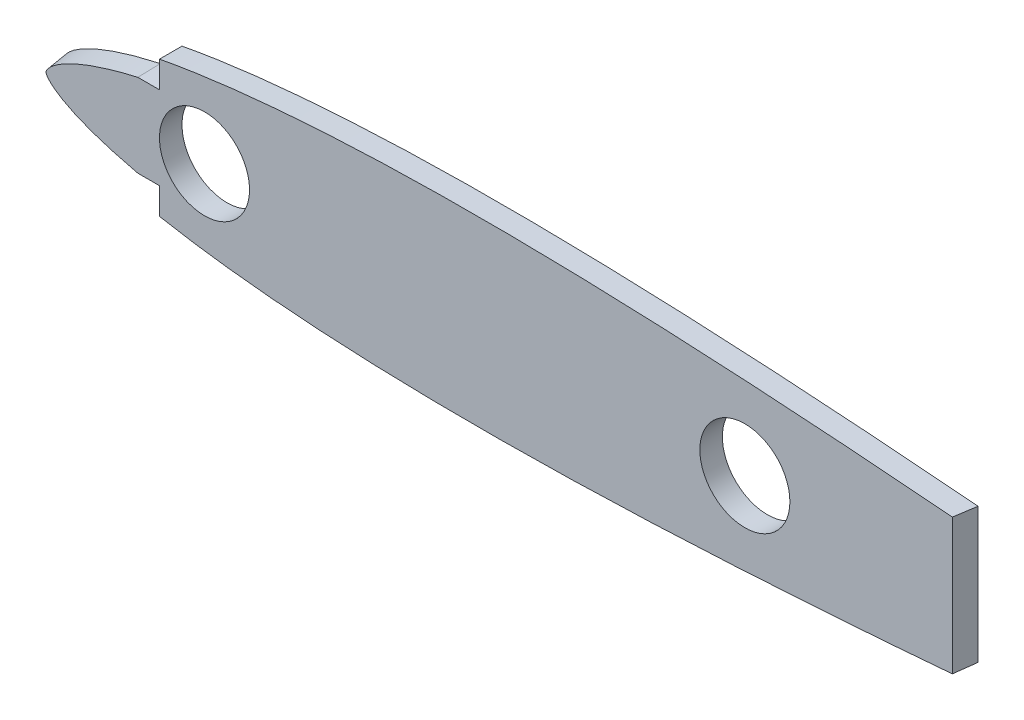
ISO-10303-21;
HEADER;
FILE_DESCRIPTION(('STEP AP214'),'2;1');
FILE_NAME('part.step','',(''),(''),'','','');
FILE_SCHEMA(('AUTOMOTIVE_DESIGN { 1 0 10303 214 1 1 1 1 }'));
ENDSEC;
DATA;
#1=APPLICATION_CONTEXT('core data for automotive mechanical design processes');
#2=APPLICATION_PROTOCOL_DEFINITION('international standard','automotive_design',2000,#1);
#3=PRODUCT_CONTEXT('',#1,'mechanical');
#4=PRODUCT('Part','Part','',(#3));
#5=PRODUCT_RELATED_PRODUCT_CATEGORY('part','',(#4));
#6=PRODUCT_DEFINITION_FORMATION('','',#4);
#7=PRODUCT_DEFINITION_CONTEXT('part definition',#1,'design');
#8=PRODUCT_DEFINITION('design','',#6,#7);
#9=PRODUCT_DEFINITION_SHAPE('','',#8);
#10=(LENGTH_UNIT() NAMED_UNIT(*) SI_UNIT(.MILLI.,.METRE.));
#11=(NAMED_UNIT(*) PLANE_ANGLE_UNIT() SI_UNIT($,.RADIAN.));
#12=(NAMED_UNIT(*) SI_UNIT($,.STERADIAN.) SOLID_ANGLE_UNIT());
#13=UNCERTAINTY_MEASURE_WITH_UNIT(LENGTH_MEASURE(1.E-05),#10,'distance_accuracy_value','');
#14=(GEOMETRIC_REPRESENTATION_CONTEXT(3) GLOBAL_UNCERTAINTY_ASSIGNED_CONTEXT((#13)) GLOBAL_UNIT_ASSIGNED_CONTEXT((#10,
#11,#12)) REPRESENTATION_CONTEXT('',''));
#15=CARTESIAN_POINT('',(0.,0.,0.));
#16=DIRECTION('',(0.,0.,1.));
#17=DIRECTION('',(1.,0.,0.));
#18=AXIS2_PLACEMENT_3D('',#15,#16,#17);
#19=CARTESIAN_POINT('',(214.122,0.26979372,3.175));
#20=CARTESIAN_POINT('',(214.042517560815,0.336401081243854,3.175));
#21=CARTESIAN_POINT('',(213.528971008812,0.273510813659236,3.175));
#22=CARTESIAN_POINT('',(212.614475706084,0.530942112134174,3.175));
#23=CARTESIAN_POINT('',(210.93741297643,0.69005818023402,3.175));
#24=CARTESIAN_POINT('',(208.678154780773,1.03154078288429,3.175));
#25=CARTESIAN_POINT('',(205.767891793944,1.41261255706814,3.175));
#26=CARTESIAN_POINT('',(202.258298365244,1.8822660000615,3.175));
#27=CARTESIAN_POINT('',(198.15850540465,2.41316460028215,3.175));
#28=CARTESIAN_POINT('',(193.498201345533,3.00425135927741,3.175));
#29=CARTESIAN_POINT('',(188.304622899694,3.64517141354976,3.175));
#30=CARTESIAN_POINT('',(182.610259265293,4.32725083103619,3.175));
#31=CARTESIAN_POINT('',(176.450111776307,5.04202983623907,3.175));
#32=CARTESIAN_POINT('',(169.862114854153,5.77977689195638,3.175));
#33=CARTESIAN_POINT('',(162.886908751652,6.53148470383703,3.175));
#34=CARTESIAN_POINT('',(155.567547263004,7.28781696456526,3.175));
#35=CARTESIAN_POINT('',(147.949138879147,8.03901128357458,3.175));
#36=CARTESIAN_POINT('',(140.078674392034,8.77452314910697,3.175));
#37=CARTESIAN_POINT('',(132.004623531841,9.48469680818573,3.175));
#38=CARTESIAN_POINT('',(123.77685377293,10.1576594283105,3.175));
#39=CARTESIAN_POINT('',(115.445921161842,10.7824383271029,3.175));
#40=CARTESIAN_POINT('',(107.063264355407,11.3474339858058,3.175));
#41=CARTESIAN_POINT('',(98.6805322459567,11.8408328326721,3.175));
#42=CARTESIAN_POINT('',(90.3493308385156,12.2501697678435,3.175));
#43=CARTESIAN_POINT('',(82.1211133669292,12.5645294411525,3.175));
#44=CARTESIAN_POINT('',(74.0463721558162,12.7736562598864,3.175));
#45=CARTESIAN_POINT('',(66.1750074581299,12.8673356782165,3.175));
#46=CARTESIAN_POINT('',(58.5553855531777,12.8381332578879,3.175));
#47=CARTESIAN_POINT('',(51.2344833966952,12.6804083153224,3.175));
#48=CARTESIAN_POINT('',(44.257364483312,12.390162695652,3.175));
#49=CARTESIAN_POINT('',(37.6669743171648,11.966637161581,3.175));
#50=CARTESIAN_POINT('',(31.5038176761954,11.4111060734603,3.175));
#51=CARTESIAN_POINT('',(25.8056086917366,10.7279081528874,3.175));
#52=CARTESIAN_POINT('',(20.6070797735584,9.92285640303968,3.175));
#53=CARTESIAN_POINT('',(15.9397327494157,9.00435890137932,3.175));
#54=CARTESIAN_POINT('',(11.8309235824545,7.98280134436973,3.175));
#55=CARTESIAN_POINT('',(8.30400030891142,6.86814519210064,3.175));
#56=CARTESIAN_POINT('',(5.37688201303167,5.67077191854433,3.175));
#57=CARTESIAN_POINT('',(3.05890335649716,4.39878231679485,3.175));
#58=CARTESIAN_POINT('',(1.35363115596886,3.04966587168943,3.175));
#59=CARTESIAN_POINT('',(0.261418185550571,1.59078439078852,3.175));
#60=CARTESIAN_POINT('',(-0.121830169011358,0.,3.175));
#61=CARTESIAN_POINT('',(0.261418185550567,-1.5907843907885,3.175));
#62=CARTESIAN_POINT('',(1.35363115596885,-3.04966587168942,3.175));
#63=CARTESIAN_POINT('',(3.05890335649717,-4.39878231679486,3.175));
#64=CARTESIAN_POINT('',(5.37688201303168,-5.67077191854434,3.175));
#65=CARTESIAN_POINT('',(8.30400030891139,-6.86814519210063,3.175));
#66=CARTESIAN_POINT('',(11.8309235824545,-7.98280134436973,3.175));
#67=CARTESIAN_POINT('',(15.9397327494157,-9.00435890137932,3.175));
#68=CARTESIAN_POINT('',(20.6070797735584,-9.92285640303967,3.175));
#69=CARTESIAN_POINT('',(25.8056086917366,-10.7279081528874,3.175));
#70=CARTESIAN_POINT('',(31.5038176761954,-11.4111060734603,3.175));
#71=CARTESIAN_POINT('',(37.6669743171648,-11.966637161581,3.175));
#72=CARTESIAN_POINT('',(44.257364483312,-12.390162695652,3.175));
#73=CARTESIAN_POINT('',(51.2344833966952,-12.6804083153224,3.175));
#74=CARTESIAN_POINT('',(58.5553855531778,-12.8381332578879,3.175));
#75=CARTESIAN_POINT('',(66.1750074581299,-12.8673356782165,3.175));
#76=CARTESIAN_POINT('',(74.0463721558162,-12.7736562598864,3.175));
#77=CARTESIAN_POINT('',(82.1211133669292,-12.5645294411525,3.175));
#78=CARTESIAN_POINT('',(90.3493308385156,-12.2501697678435,3.175));
#79=CARTESIAN_POINT('',(98.6805322459566,-11.8408328326721,3.175));
#80=CARTESIAN_POINT('',(107.063264355407,-11.3474339858058,3.175));
#81=CARTESIAN_POINT('',(115.445921161842,-10.7824383271029,3.175));
#82=CARTESIAN_POINT('',(123.77685377293,-10.1576594283105,3.175));
#83=CARTESIAN_POINT('',(132.004623531841,-9.48469680818572,3.175));
#84=CARTESIAN_POINT('',(140.078674392034,-8.77452314910697,3.175));
#85=CARTESIAN_POINT('',(147.949138879147,-8.03901128357458,3.175));
#86=CARTESIAN_POINT('',(155.567547263004,-7.28781696456527,3.175));
#87=CARTESIAN_POINT('',(162.886908751652,-6.53148470383702,3.175));
#88=CARTESIAN_POINT('',(169.862114854153,-5.77977689195639,3.175));
#89=CARTESIAN_POINT('',(176.450111776307,-5.04202983623907,3.175));
#90=CARTESIAN_POINT('',(182.610259265293,-4.32725083103619,3.175));
#91=CARTESIAN_POINT('',(188.304622899694,-3.64517141354977,3.175));
#92=CARTESIAN_POINT('',(193.498201345533,-3.0042513592774,3.175));
#93=CARTESIAN_POINT('',(198.15850540465,-2.41316460028216,3.175));
#94=CARTESIAN_POINT('',(202.258298365244,-1.8822660000615,3.175));
#95=CARTESIAN_POINT('',(205.767891793944,-1.41261255706814,3.175));
#96=CARTESIAN_POINT('',(208.678154780773,-1.0315407828843,3.175));
#97=CARTESIAN_POINT('',(210.937412976431,-0.69005818023401,3.175));
#98=CARTESIAN_POINT('',(212.614475706083,-0.530942112134185,3.175));
#99=CARTESIAN_POINT('',(213.528971008813,-0.273510813659228,3.175));
#100=CARTESIAN_POINT('',(214.250719430012,-0.361898032229822,3.175));
#101=CARTESIAN_POINT('',(214.250719430012,0.161925093145306,3.175));
#102=CARTESIAN_POINT('',(214.122,0.26979372,3.175));
#103=B_SPLINE_CURVE_WITH_KNOTS('',3,(#19,#20,#21,#22,#23,#24,#25,#26,#27,#28,#29,#30,#31,#32,
#33,#34,#35,#36,#37,#38,#39,#40,#41,#42,#43,#44,#45,#46,#47,#48,#49,#50,#51,#52,#53,#54,#55,#56,
#57,#58,#59,#60,#61,#62,#63,#64,#65,#66,#67,#68,#69,#70,#71,#72,#73,#74,#75,#76,#77,#78,#79,#80,
#81,#82,#83,#84,#85,#86,#87,#88,#89,#90,#91,#92,#93,#94,#95,#96,#97,#98,#99,#100,#101,#102),
.UNSPECIFIED.,.T.,.F.,(4,1,1,1,1,1,1,1,1,1,1,1,1,1,1,1,1,1,1,1,1,1,1,1,1,1,1,1,1,1,1,1,1,1,1,1,
1,1,1,1,1,1,1,1,1,1,1,1,1,1,1,1,1,1,1,1,1,1,1,1,1,1,1,1,1,1,1,1,1,1,1,1,1,1,1,1,1,1,1,1,1,4),
(0.,0.000762214651028502,0.00304470631082166,0.00683224554312915,0.0121011758037585,
0.0188175356586857,0.026939454793122,0.0364148482585567,0.0471846285955963,0.0591804130998147,
0.0723278736139124,0.0865440610891482,0.101740580336553,0.117823336433574,0.134691452208322,
0.152240154447154,0.170361289964637,0.188941007849542,0.207865435445639,0.227016078022501,
0.246275695980001,0.265524943249895,0.284644966110444,0.303520118268661,0.322034575374331,
0.340078352914118,0.357542593241702,0.374325481920834,0.390329890871888,0.405463889739094,
0.419643801445684,0.43279337139134,0.444843816743186,0.455737920704734,0.465428653233084,
0.473886320085415,0.481101634077568,0.487101684418678,0.491975368345093,0.495930677807379,
0.499382808099288,0.502834938391197,0.506790247853483,0.511663931779898,0.517663982121008,
0.524879296113161,0.533336962965492,0.543027695493842,0.55392179945539,0.565972244807236,
0.579121814752892,0.593301726459482,0.608435725326688,0.624440134277742,0.641223022956874,
0.658687263284458,0.676731040824245,0.695245497929915,0.714120650088133,0.733240672948681,
0.752489920218576,0.771749538176075,0.790900180752937,0.809824608349034,0.82840432623394,
0.846525461751422,0.864074163990254,0.880942279765002,0.897025035862024,0.912221555109428,
0.926437742584664,0.939585203098762,0.95158098760298,0.96235076794002,0.971826161405454,
0.979948080539891,0.986664440394818,0.991933370655447,0.995720909887755,0.998003401547548,
0.998765616198576,1.),.UNSPECIFIED.);
#104=DIRECTION('',(0.,0.,-1.));
#105=VECTOR('',#104,1.);
#106=SURFACE_OF_LINEAR_EXTRUSION('',#103,#105);
#107=CARTESIAN_POINT('',(214.122,0.26979372,0.));
#108=CARTESIAN_POINT('',(214.042517560815,0.336401081243854,0.));
#109=CARTESIAN_POINT('',(213.528971008812,0.273510813659236,0.));
#110=CARTESIAN_POINT('',(212.614475706084,0.530942112134174,0.));
#111=CARTESIAN_POINT('',(210.93741297643,0.69005818023402,0.));
#112=CARTESIAN_POINT('',(208.678154780773,1.03154078288429,0.));
#113=CARTESIAN_POINT('',(205.767891793944,1.41261255706814,0.));
#114=CARTESIAN_POINT('',(202.258298365244,1.8822660000615,0.));
#115=CARTESIAN_POINT('',(198.15850540465,2.41316460028215,0.));
#116=CARTESIAN_POINT('',(193.498201345533,3.00425135927741,0.));
#117=CARTESIAN_POINT('',(188.304622899694,3.64517141354976,0.));
#118=CARTESIAN_POINT('',(182.610259265293,4.32725083103619,0.));
#119=CARTESIAN_POINT('',(176.450111776307,5.04202983623907,0.));
#120=CARTESIAN_POINT('',(169.862114854153,5.77977689195638,0.));
#121=CARTESIAN_POINT('',(162.886908751652,6.53148470383703,0.));
#122=CARTESIAN_POINT('',(155.567547263004,7.28781696456526,0.));
#123=CARTESIAN_POINT('',(147.949138879147,8.03901128357458,0.));
#124=CARTESIAN_POINT('',(140.078674392034,8.77452314910697,0.));
#125=CARTESIAN_POINT('',(132.004623531841,9.48469680818573,0.));
#126=CARTESIAN_POINT('',(123.77685377293,10.1576594283105,0.));
#127=CARTESIAN_POINT('',(115.445921161842,10.7824383271029,0.));
#128=CARTESIAN_POINT('',(107.063264355407,11.3474339858058,0.));
#129=CARTESIAN_POINT('',(98.6805322459567,11.8408328326721,0.));
#130=CARTESIAN_POINT('',(90.3493308385156,12.2501697678435,0.));
#131=CARTESIAN_POINT('',(82.1211133669292,12.5645294411525,0.));
#132=CARTESIAN_POINT('',(74.0463721558162,12.7736562598864,0.));
#133=CARTESIAN_POINT('',(66.1750074581299,12.8673356782165,0.));
#134=CARTESIAN_POINT('',(58.5553855531777,12.8381332578879,0.));
#135=CARTESIAN_POINT('',(51.2344833966952,12.6804083153224,0.));
#136=CARTESIAN_POINT('',(44.257364483312,12.390162695652,0.));
#137=CARTESIAN_POINT('',(37.6669743171648,11.966637161581,0.));
#138=CARTESIAN_POINT('',(31.5038176761954,11.4111060734603,0.));
#139=CARTESIAN_POINT('',(25.8056086917366,10.7279081528874,0.));
#140=CARTESIAN_POINT('',(20.6070797735584,9.92285640303968,0.));
#141=CARTESIAN_POINT('',(15.9397327494157,9.00435890137932,0.));
#142=CARTESIAN_POINT('',(11.8309235824545,7.98280134436973,0.));
#143=CARTESIAN_POINT('',(8.30400030891142,6.86814519210064,0.));
#144=CARTESIAN_POINT('',(5.37688201303167,5.67077191854433,0.));
#145=CARTESIAN_POINT('',(3.05890335649716,4.39878231679485,0.));
#146=CARTESIAN_POINT('',(1.35363115596886,3.04966587168943,0.));
#147=CARTESIAN_POINT('',(0.261418185550571,1.59078439078852,0.));
#148=CARTESIAN_POINT('',(-0.121830169011358,0.,0.));
#149=CARTESIAN_POINT('',(0.261418185550567,-1.5907843907885,0.));
#150=CARTESIAN_POINT('',(1.35363115596885,-3.04966587168942,0.));
#151=CARTESIAN_POINT('',(3.05890335649717,-4.39878231679486,0.));
#152=CARTESIAN_POINT('',(5.37688201303168,-5.67077191854434,0.));
#153=CARTESIAN_POINT('',(8.30400030891139,-6.86814519210063,0.));
#154=CARTESIAN_POINT('',(11.8309235824545,-7.98280134436973,0.));
#155=CARTESIAN_POINT('',(15.9397327494157,-9.00435890137932,0.));
#156=CARTESIAN_POINT('',(20.6070797735584,-9.92285640303967,0.));
#157=CARTESIAN_POINT('',(25.8056086917366,-10.7279081528874,0.));
#158=CARTESIAN_POINT('',(31.5038176761954,-11.4111060734603,0.));
#159=CARTESIAN_POINT('',(37.6669743171648,-11.966637161581,0.));
#160=CARTESIAN_POINT('',(44.257364483312,-12.390162695652,0.));
#161=CARTESIAN_POINT('',(51.2344833966952,-12.6804083153224,0.));
#162=CARTESIAN_POINT('',(58.5553855531778,-12.8381332578879,0.));
#163=CARTESIAN_POINT('',(66.1750074581299,-12.8673356782165,0.));
#164=CARTESIAN_POINT('',(74.0463721558162,-12.7736562598864,0.));
#165=CARTESIAN_POINT('',(82.1211133669292,-12.5645294411525,0.));
#166=CARTESIAN_POINT('',(90.3493308385156,-12.2501697678435,0.));
#167=CARTESIAN_POINT('',(98.6805322459566,-11.8408328326721,0.));
#168=CARTESIAN_POINT('',(107.063264355407,-11.3474339858058,0.));
#169=CARTESIAN_POINT('',(115.445921161842,-10.7824383271029,0.));
#170=CARTESIAN_POINT('',(123.77685377293,-10.1576594283105,0.));
#171=CARTESIAN_POINT('',(132.004623531841,-9.48469680818572,0.));
#172=CARTESIAN_POINT('',(140.078674392034,-8.77452314910697,0.));
#173=CARTESIAN_POINT('',(147.949138879147,-8.03901128357458,0.));
#174=CARTESIAN_POINT('',(155.567547263004,-7.28781696456527,0.));
#175=CARTESIAN_POINT('',(162.886908751652,-6.53148470383702,0.));
#176=CARTESIAN_POINT('',(169.862114854153,-5.77977689195639,0.));
#177=CARTESIAN_POINT('',(176.450111776307,-5.04202983623907,0.));
#178=CARTESIAN_POINT('',(182.610259265293,-4.32725083103619,0.));
#179=CARTESIAN_POINT('',(188.304622899694,-3.64517141354977,0.));
#180=CARTESIAN_POINT('',(193.498201345533,-3.0042513592774,0.));
#181=CARTESIAN_POINT('',(198.15850540465,-2.41316460028216,0.));
#182=CARTESIAN_POINT('',(202.258298365244,-1.8822660000615,0.));
#183=CARTESIAN_POINT('',(205.767891793944,-1.41261255706814,0.));
#184=CARTESIAN_POINT('',(208.678154780773,-1.0315407828843,0.));
#185=CARTESIAN_POINT('',(210.937412976431,-0.69005818023401,0.));
#186=CARTESIAN_POINT('',(212.614475706083,-0.530942112134185,0.));
#187=CARTESIAN_POINT('',(213.528971008813,-0.273510813659228,0.));
#188=CARTESIAN_POINT('',(214.250719430012,-0.361898032229822,0.));
#189=CARTESIAN_POINT('',(214.250719430012,0.161925093145306,0.));
#190=CARTESIAN_POINT('',(214.122,0.26979372,0.));
#191=B_SPLINE_CURVE_WITH_KNOTS('',3,(#107,#108,#109,#110,#111,#112,#113,#114,#115,#116,#117,
#118,#119,#120,#121,#122,#123,#124,#125,#126,#127,#128,#129,#130,#131,#132,#133,#134,#135,#136,
#137,#138,#139,#140,#141,#142,#143,#144,#145,#146,#147,#148,#149,#150,#151,#152,#153,#154,#155,
#156,#157,#158,#159,#160,#161,#162,#163,#164,#165,#166,#167,#168,#169,#170,#171,#172,#173,#174,
#175,#176,#177,#178,#179,#180,#181,#182,#183,#184,#185,#186,#187,#188,#189,#190),.UNSPECIFIED.,
.T.,.F.,(4,1,1,1,1,1,1,1,1,1,1,1,1,1,1,1,1,1,1,1,1,1,1,1,1,1,1,1,1,1,1,1,1,1,1,1,1,1,1,1,1,1,1,
1,1,1,1,1,1,1,1,1,1,1,1,1,1,1,1,1,1,1,1,1,1,1,1,1,1,1,1,1,1,1,1,1,1,1,1,1,1,4),(0.,
0.000762214651028502,0.00304470631082166,0.00683224554312915,0.0121011758037585,
0.0188175356586857,0.026939454793122,0.0364148482585567,0.0471846285955963,0.0591804130998147,
0.0723278736139124,0.0865440610891482,0.101740580336553,0.117823336433574,0.134691452208322,
0.152240154447154,0.170361289964637,0.188941007849542,0.207865435445639,0.227016078022501,
0.246275695980001,0.265524943249895,0.284644966110444,0.303520118268661,0.322034575374331,
0.340078352914118,0.357542593241702,0.374325481920834,0.390329890871888,0.405463889739094,
0.419643801445684,0.43279337139134,0.444843816743186,0.455737920704734,0.465428653233084,
0.473886320085415,0.481101634077568,0.487101684418678,0.491975368345093,0.495930677807379,
0.499382808099288,0.502834938391197,0.506790247853483,0.511663931779898,0.517663982121008,
0.524879296113161,0.533336962965492,0.543027695493842,0.55392179945539,0.565972244807236,
0.579121814752892,0.593301726459482,0.608435725326688,0.624440134277742,0.641223022956874,
0.658687263284458,0.676731040824245,0.695245497929915,0.714120650088133,0.733240672948681,
0.752489920218576,0.771749538176075,0.790900180752937,0.809824608349034,0.82840432623394,
0.846525461751422,0.864074163990254,0.880942279765002,0.897025035862024,0.912221555109428,
0.926437742584664,0.939585203098762,0.95158098760298,0.96235076794002,0.971826161405454,
0.979948080539891,0.986664440394818,0.991933370655447,0.995720909887755,0.998003401547548,
0.998765616198576,1.),.UNSPECIFIED.);
#192=CARTESIAN_POINT('',(131.301372668842,9.53579701474347,0.));
#193=VERTEX_POINT('',#192);
#194=CARTESIAN_POINT('',(19.0500000003695,9.60451624978711,0.));
#195=VERTEX_POINT('',#194);
#196=EDGE_CURVE('E309',#193,#195,#191,.T.);
#197=ORIENTED_EDGE('',*,*,#196,.T.);
#198=DIRECTION('',(0.,0.,-1.));
#199=VECTOR('',#198,1.);
#200=CARTESIAN_POINT('',(19.0500000003695,9.60451624978709,3.175));
#201=LINE('',#200,#199);
#202=CARTESIAN_POINT('',(19.0500000003695,9.60451624970407,3.175));
#203=VERTEX_POINT('',#202);
#204=EDGE_CURVE('E258',#195,#203,#201,.F.);
#205=ORIENTED_EDGE('',*,*,#204,.T.);
#206=CARTESIAN_POINT('',(130.854723982681,9.57338768164103,3.17500000000012));
#207=VERTEX_POINT('',#206);
#208=EDGE_CURVE('E317',#207,#203,#103,.T.);
#209=ORIENTED_EDGE('',*,*,#208,.F.);
#210=CARTESIAN_POINT('',(130.85472397327,9.57338768165686,3.17500000127339));
#211=CARTESIAN_POINT('',(131.003606871669,9.56085745882676,2.1166666684076));
#212=CARTESIAN_POINT('',(131.152489770067,9.54832723599667,1.05833333554182));
#213=CARTESIAN_POINT('',(131.301372668465,9.53579701316657,2.67602823580959E-09));
#214=B_SPLINE_CURVE_WITH_KNOTS('',3,(#210,#211,#212,#213),.UNSPECIFIED.,.F.,.F.,(4,4),(0.,
3.20648298083275),.UNSPECIFIED.);
#215=EDGE_CURVE('E276',#207,#193,#214,.T.);
#216=ORIENTED_EDGE('',*,*,#215,.T.);
#217=EDGE_LOOP('',(#197,#205,#209,#216));
#218=FACE_BOUND('',#217,.T.);
#219=ADVANCED_FACE('F100',(#218),#106,.F.);
#220=CARTESIAN_POINT('',(19.0500000003695,-9.60451624973119,3.175));
#221=VERTEX_POINT('',#220);
#222=CARTESIAN_POINT('',(130.854723982681,-9.57338768164103,3.17500000000012));
#223=VERTEX_POINT('',#222);
#224=EDGE_CURVE('E193',#221,#223,#103,.T.);
#225=ORIENTED_EDGE('',*,*,#224,.F.);
#226=DIRECTION('',(0.,0.,-1.));
#227=VECTOR('',#226,1.);
#228=CARTESIAN_POINT('',(19.0500000003695,-9.60451624978709,3.175));
#229=LINE('',#228,#227);
#230=CARTESIAN_POINT('',(19.0500000003696,-9.60451624978714,0.));
#231=VERTEX_POINT('',#230);
#232=EDGE_CURVE('E164',#221,#231,#229,.T.);
#233=ORIENTED_EDGE('',*,*,#232,.T.);
#234=CARTESIAN_POINT('',(131.301372649766,-9.53579701474347,0.));
#235=VERTEX_POINT('',#234);
#236=EDGE_CURVE('E315',#231,#235,#191,.T.);
#237=ORIENTED_EDGE('',*,*,#236,.T.);
#238=CARTESIAN_POINT('',(131.301372659022,-9.53579701475949,1.32878630294753E-09));
#239=CARTESIAN_POINT('',(131.152489766908,-9.54832723654173,1.05833333421923));
#240=CARTESIAN_POINT('',(131.003606874794,-9.56085745832397,2.11666666710968));
#241=CARTESIAN_POINT('',(130.854723982681,-9.57338768010621,3.17500000000012));
#242=B_SPLINE_CURVE_WITH_KNOTS('',3,(#238,#239,#240,#241),.UNSPECIFIED.,.F.,.F.,(4,4),(0.,
3.20648297824297),.UNSPECIFIED.);
#243=EDGE_CURVE('E268',#235,#223,#242,.T.);
#244=ORIENTED_EDGE('',*,*,#243,.T.);
#245=EDGE_LOOP('',(#225,#233,#237,#244));
#246=FACE_BOUND('',#245,.T.);
#247=ADVANCED_FACE('F102',(#246),#106,.F.);
#248=CARTESIAN_POINT('',(0.0114796345108349,-0.270976882837512,3.175));
#249=DIRECTION('',(0.,0.,-1.));
#250=DIRECTION('',(-1.,0.,0.));
#251=AXIS2_PLACEMENT_3D('',#248,#249,#250);
#252=PLANE('',#251);
#253=CARTESIAN_POINT('',(25.4,0.,3.175));
#254=DIRECTION('',(0.,0.,1.));
#255=DIRECTION('',(1.,0.,0.));
#256=AXIS2_PLACEMENT_3D('',#253,#254,#255);
#257=CIRCLE('',#256,6.35);
#258=CARTESIAN_POINT('',(31.75,0.,3.175));
#259=VERTEX_POINT('',#258);
#260=EDGE_CURVE('E370',#259,#259,#257,.T.);
#261=ORIENTED_EDGE('',*,*,#260,.F.);
#262=EDGE_LOOP('',(#261));
#263=FACE_BOUND('',#262,.T.);
#264=CARTESIAN_POINT('',(101.6,0.,3.175));
#265=DIRECTION('',(0.,0.,1.));
#266=DIRECTION('',(1.,0.,0.));
#267=AXIS2_PLACEMENT_3D('',#264,#265,#266);
#268=CIRCLE('',#267,6.35);
#269=CARTESIAN_POINT('',(107.95,0.,3.175));
#270=VERTEX_POINT('',#269);
#271=EDGE_CURVE('E371',#270,#270,#268,.T.);
#272=ORIENTED_EDGE('',*,*,#271,.F.);
#273=EDGE_LOOP('',(#272));
#274=FACE_BOUND('',#273,.T.);
#275=ORIENTED_EDGE('',*,*,#208,.T.);
#276=DIRECTION('',(0.,1.,0.));
#277=VECTOR('',#276,1.);
#278=CARTESIAN_POINT('',(19.0500000003695,9.60451624970407,3.175));
#279=LINE('',#278,#277);
#280=CARTESIAN_POINT('',(19.0500000003695,5.85638897249013,3.175));
#281=VERTEX_POINT('',#280);
#282=EDGE_CURVE('E168',#281,#203,#279,.T.);
#283=ORIENTED_EDGE('',*,*,#282,.F.);
#284=DIRECTION('',(0.99999997363691,0.000229621819136764,0.));
#285=VECTOR('',#284,1.);
#286=CARTESIAN_POINT('',(16.0020000003695,5.85568908516695,3.175));
#287=LINE('',#286,#285);
#288=CARTESIAN_POINT('',(16.0020000003695,5.85568908516695,3.175));
#289=VERTEX_POINT('',#288);
#290=EDGE_CURVE('E227',#289,#281,#287,.T.);
#291=ORIENTED_EDGE('',*,*,#290,.F.);
#292=CARTESIAN_POINT('',(16.0020000003695,-5.85568908519615,3.175));
#293=CARTESIAN_POINT('',(15.2789856994235,-5.6896727281803,3.175));
#294=CARTESIAN_POINT('',(14.1916408117708,-5.42480163725791,3.175));
#295=CARTESIAN_POINT('',(12.757897505027,-5.03792126742858,3.175));
#296=CARTESIAN_POINT('',(11.6936418979375,-4.72976736687447,3.175));
#297=CARTESIAN_POINT('',(10.6467125295672,-4.40334022513178,3.175));
#298=CARTESIAN_POINT('',(9.61769030593886,-4.05579733014744,3.175));
#299=CARTESIAN_POINT('',(8.60829519742746,-3.68457224278906,3.175));
#300=CARTESIAN_POINT('',(7.6262338945128,-3.28791903124734,3.175));
#301=CARTESIAN_POINT('',(6.67853682411654,-2.86370782750951,3.175));
#302=CARTESIAN_POINT('',(5.77925724029933,-2.40895603063091,3.175));
#303=CARTESIAN_POINT('',(5.07877336856587,-2.00037425753491,3.175));
#304=CARTESIAN_POINT('',(4.57098155341039,-1.66547781224419,3.175));
#305=CARTESIAN_POINT('',(4.22013147521115,-1.41150205920332,3.175));
#306=CARTESIAN_POINT('',(3.90592310714061,-1.15765283869051,3.175));
#307=CARTESIAN_POINT('',(3.63115281698854,-0.904648932859187,3.175));
#308=CARTESIAN_POINT('',(3.39988805271733,-0.653946014573165,3.175));
#309=CARTESIAN_POINT('',(3.22674214454738,-0.433066134601034,3.175));
#310=CARTESIAN_POINT('',(3.12667694746586,-0.26973264073914,3.175));
#311=CARTESIAN_POINT('',(3.07552574410714,-0.144421699527457,3.175));
#312=CARTESIAN_POINT('',(3.04921853983129,-0.037663309925085,3.175));
#313=CARTESIAN_POINT('',(3.04739029788582,5.51605453750614E-08,3.175));
#314=CARTESIAN_POINT('',(3.04921842867691,0.037663176559775,3.175));
#315=CARTESIAN_POINT('',(3.07552602040503,0.144421915471158,3.175));
#316=CARTESIAN_POINT('',(3.12667628361713,0.269732200320572,3.175));
#317=CARTESIAN_POINT('',(3.22674345055361,0.433066972418017,3.175));
#318=CARTESIAN_POINT('',(3.39988557432835,0.653944438612997,3.175));
#319=CARTESIAN_POINT('',(3.63115750478139,0.904651906183884,3.175));
#320=CARTESIAN_POINT('',(3.9059140227642,1.15764708089247,3.175));
#321=CARTESIAN_POINT('',(4.22015101296176,1.41151443869258,3.175));
#322=CARTESIAN_POINT('',(4.5709467001209,1.66545573694329,3.175));
#323=CARTESIAN_POINT('',(5.07891080079693,2.00046124051816,3.175));
#324=CARTESIAN_POINT('',(5.77918210716232,2.40890834049938,3.175));
#325=CARTESIAN_POINT('',(6.67857341083341,2.86373129979662,3.175));
#326=CARTESIAN_POINT('',(7.62621623215463,3.28790719042408,3.175));
#327=CARTESIAN_POINT('',(8.60830163720482,3.68457765807501,3.175));
#328=CARTESIAN_POINT('',(9.61769250431702,4.05579604741332,3.175));
#329=CARTESIAN_POINT('',(10.6467003159682,4.40333789419711,3.175));
#330=CARTESIAN_POINT('',(11.6936727803781,4.72977505523375,3.175));
#331=CARTESIAN_POINT('',(12.7578433633768,5.03790746458274,3.175));
#332=CARTESIAN_POINT('',(14.1918341864765,5.42485155802043,3.175));
#333=CARTESIAN_POINT('',(15.2789856994235,5.68967272815071,3.175));
#334=CARTESIAN_POINT('',(16.0020000003695,5.85568908516695,3.175));
#335=B_SPLINE_CURVE_WITH_KNOTS('',3,(#292,#293,#294,#295,#296,#297,#298,#299,#300,#301,#302,
#303,#304,#305,#306,#307,#308,#309,#310,#311,#312,#313,#314,#315,#316,#317,#318,#319,#320,#321,
#322,#323,#324,#325,#326,#327,#328,#329,#330,#331,#332,#333,#334),.UNSPECIFIED.,.F.,.F.,(4,1,1,
1,1,1,1,1,1,1,1,1,1,1,1,1,1,1,1,1,1,1,1,1,1,1,1,1,1,1,1,1,1,1,1,1,1,1,1,1,4),(0.,0.0625,0.09375,
0.125,0.15625,0.1875,0.21875,0.25,0.28125,0.3125,0.34375,0.359375,0.375,0.390625,0.40625,
0.421875,0.4375,0.453125,0.46875,0.484375,0.5,0.515625,0.53125,0.546875,0.5625,0.578125,0.59375,
0.609375,0.625,0.640625,0.65625,0.6875,0.71875,0.75,0.78125,0.8125,0.84375,0.875,0.90625,0.9375,
1.),.UNSPECIFIED.);
#336=CARTESIAN_POINT('',(16.0020000003695,-5.85568908519615,3.175));
#337=VERTEX_POINT('',#336);
#338=EDGE_CURVE('E188',#337,#289,#335,.T.);
#339=ORIENTED_EDGE('',*,*,#338,.F.);
#340=DIRECTION('',(-0.99999997363691,0.000229621818945536,0.));
#341=VECTOR('',#340,1.);
#342=CARTESIAN_POINT('',(16.0020000003695,-5.85568908519615,3.175));
#343=LINE('',#342,#341);
#344=CARTESIAN_POINT('',(19.0500000003695,-5.85638897251875,3.175));
#345=VERTEX_POINT('',#344);
#346=EDGE_CURVE('E169',#345,#337,#343,.T.);
#347=ORIENTED_EDGE('',*,*,#346,.F.);
#348=DIRECTION('',(0.,1.,0.));
#349=VECTOR('',#348,1.);
#350=CARTESIAN_POINT('',(19.0500000003695,-5.85638897251875,3.175));
#351=LINE('',#350,#349);
#352=EDGE_CURVE('E161',#221,#345,#351,.T.);
#353=ORIENTED_EDGE('',*,*,#352,.F.);
#354=ORIENTED_EDGE('',*,*,#224,.T.);
#355=DIRECTION('',(0.,1.,0.));
#356=VECTOR('',#355,1.);
#357=CARTESIAN_POINT('',(130.854723982681,-12.8673356782165,3.17500000000012));
#358=LINE('',#357,#356);
#359=EDGE_CURVE('E263',#223,#207,#358,.T.);
#360=ORIENTED_EDGE('',*,*,#359,.T.);
#361=EDGE_LOOP('',(#275,#283,#291,#339,#347,#353,#354,#360));
#362=FACE_BOUND('',#361,.T.);
#363=ADVANCED_FACE('F186',(#263,#274,#362),#252,.F.);
#364=CARTESIAN_POINT('',(0.0114796345108349,-0.270976882837512,0.));
#365=DIRECTION('',(0.,0.,-1.));
#366=DIRECTION('',(-1.,0.,0.));
#367=AXIS2_PLACEMENT_3D('',#364,#365,#366);
#368=PLANE('',#367);
#369=DIRECTION('',(0.,-1.,0.));
#370=VECTOR('',#369,1.);
#371=CARTESIAN_POINT('',(19.0500000003695,13.4998443050165,0.));
#372=LINE('',#371,#370);
#373=CARTESIAN_POINT('',(19.0500000003697,5.95224212413286,0.));
#374=VERTEX_POINT('',#373);
#375=EDGE_CURVE('E12',#195,#374,#372,.T.);
#376=ORIENTED_EDGE('',*,*,#375,.F.);
#377=ORIENTED_EDGE('',*,*,#196,.F.);
#378=DIRECTION('',(0.,1.,0.));
#379=VECTOR('',#378,1.);
#380=CARTESIAN_POINT('',(131.301372668842,-0.270976882837512,0.));
#381=LINE('',#380,#379);
#382=EDGE_CURVE('E112',#235,#193,#381,.T.);
#383=ORIENTED_EDGE('',*,*,#382,.F.);
#384=ORIENTED_EDGE('',*,*,#236,.F.);
#385=DIRECTION('',(0.,-1.,0.));
#386=VECTOR('',#385,1.);
#387=CARTESIAN_POINT('',(19.0500000003695,-9.69489597960858,0.));
#388=LINE('',#387,#386);
#389=CARTESIAN_POINT('',(19.0500000003697,-5.95224212416929,0.));
#390=VERTEX_POINT('',#389);
#391=EDGE_CURVE('E181',#390,#231,#388,.T.);
#392=ORIENTED_EDGE('',*,*,#391,.F.);
#393=DIRECTION('',(1.,2.05457734523501E-13,0.));
#394=VECTOR('',#393,1.);
#395=CARTESIAN_POINT('',(16.0020000003697,-5.95224212416992,0.));
#396=LINE('',#395,#394);
#397=CARTESIAN_POINT('',(16.0020000003697,-5.95224212416992,0.));
#398=VERTEX_POINT('',#397);
#399=EDGE_CURVE('E178',#398,#390,#396,.T.);
#400=ORIENTED_EDGE('',*,*,#399,.F.);
#401=CARTESIAN_POINT('',(16.0020000003697,5.95224212413293,0.));
#402=CARTESIAN_POINT('',(15.2547706552665,5.78657595967484,0.));
#403=CARTESIAN_POINT('',(14.1313209523382,5.52198103093419,0.));
#404=CARTESIAN_POINT('',(12.6489312297221,5.13459921137253,0.));
#405=CARTESIAN_POINT('',(11.5484361230537,4.82572335231564,0.));
#406=CARTESIAN_POINT('',(10.4650518783353,4.4980739407818,0.));
#407=CARTESIAN_POINT('',(9.39959077118277,4.1488002106298,0.));
#408=CARTESIAN_POINT('',(8.35369696534777,3.7752709707968,0.));
#409=CARTESIAN_POINT('',(7.5048514454042,3.44221855488807,0.));
#410=CARTESIAN_POINT('',(6.84293448203521,3.16162380700668,0.));
#411=CARTESIAN_POINT('',(6.19479487733568,2.87104233678663,0.));
#412=CARTESIAN_POINT('',(5.41472804055013,2.48803914717197,0.));
#413=CARTESIAN_POINT('',(4.68387781554342,2.07462994151062,0.));
#414=CARTESIAN_POINT('',(4.15137319297331,1.73475279899465,0.));
#415=CARTESIAN_POINT('',(3.78216467873558,1.47661699734675,0.));
#416=CARTESIAN_POINT('',(3.44954912401146,1.21792525040416,0.));
#417=CARTESIAN_POINT('',(3.15654569604758,0.959314296280195,0.));
#418=CARTESIAN_POINT('',(2.90735717037427,0.702084345026653,0.));
#419=CARTESIAN_POINT('',(2.71691191326543,0.473376026806565,0.));
#420=CARTESIAN_POINT('',(2.62000749360235,0.329250423586216,0.));
#421=CARTESIAN_POINT('',(2.56827836489106,0.232230215970853,0.));
#422=CARTESIAN_POINT('',(2.53973088659934,0.166366119163704,0.));
#423=CARTESIAN_POINT('',(2.51856333497639,0.105023254281542,0.));
#424=CARTESIAN_POINT('',(2.50540727595675,0.0553433448490329,0.));
#425=CARTESIAN_POINT('',(2.49969893731184,0.0229620586405818,0.));
#426=CARTESIAN_POINT('',(2.49872280812928,3.73505668557107E-08,0.));
#427=CARTESIAN_POINT('',(2.49969901425562,-0.0229621023174067,0.));
#428=CARTESIAN_POINT('',(2.50540727693621,-0.0553433592362417,0.));
#429=CARTESIAN_POINT('',(2.51856334556962,-0.105023288427985,0.));
#430=CARTESIAN_POINT('',(2.5397305984351,-0.166365890564517,0.));
#431=CARTESIAN_POINT('',(2.56827846220354,-0.232230258004844,0.));
#432=CARTESIAN_POINT('',(2.62001263089283,-0.329254292031474,0.));
#433=CARTESIAN_POINT('',(2.71690784175481,-0.473373090191979,0.));
#434=CARTESIAN_POINT('',(2.90736105261376,-0.702086988848106,0.));
#435=CARTESIAN_POINT('',(3.15654025145574,-0.959310742765801,0.));
#436=CARTESIAN_POINT('',(3.44955864793086,-1.21793135366871,0.));
#437=CARTESIAN_POINT('',(3.78214505134977,-1.47660452371028,0.));
#438=CARTESIAN_POINT('',(4.15140783298008,-1.73477475924949,0.));
#439=CARTESIAN_POINT('',(4.68374169500421,-2.07454376803534,0.));
#440=CARTESIAN_POINT('',(5.41480415491206,-2.48808676026073,0.));
#441=CARTESIAN_POINT('',(6.19477711254108,-2.87103083416358,0.));
#442=CARTESIAN_POINT('',(6.84292502982929,-3.16161805000876,0.));
#443=CARTESIAN_POINT('',(7.50486634986816,-3.44222764209992,0.));
#444=CARTESIAN_POINT('',(8.35368956274626,-3.77526546039673,0.));
#445=CARTESIAN_POINT('',(9.3995891412589,-4.14880155600749,0.));
#446=CARTESIAN_POINT('',(10.4650636693294,-4.49807620804362,0.));
#447=CARTESIAN_POINT('',(11.5484057300089,-4.82571576652077,0.));
#448=CARTESIAN_POINT('',(12.6489847025075,-5.13461285512876,0.));
#449=CARTESIAN_POINT('',(14.1311297562977,-5.52193165982447,0.));
#450=CARTESIAN_POINT('',(15.2547706552665,-5.78657595971116,0.));
#451=CARTESIAN_POINT('',(16.0020000003697,-5.95224212416992,0.));
#452=B_SPLINE_CURVE_WITH_KNOTS('',3,(#401,#402,#403,#404,#405,#406,#407,#408,#409,#410,#411,
#412,#413,#414,#415,#416,#417,#418,#419,#420,#421,#422,#423,#424,#425,#426,#427,#428,#429,#430,
#431,#432,#433,#434,#435,#436,#437,#438,#439,#440,#441,#442,#443,#444,#445,#446,#447,#448,#449,
#450,#451),.UNSPECIFIED.,.F.,.F.,(4,1,1,1,1,1,1,1,1,1,1,1,1,1,1,1,1,1,1,1,1,1,1,1,1,1,1,1,1,1,1,
1,1,1,1,1,1,1,1,1,1,1,1,1,1,1,1,1,4),(0.,0.0625,0.09375,0.125,0.15625,0.1875,0.21875,0.25,
0.265625,0.28125,0.3125,0.34375,0.359375,0.375,0.390625,0.40625,0.421875,0.4375,0.453125,
0.4609375,0.46875,0.4765625,0.484375,0.4921875,0.5,0.5078125,0.515625,0.5234375,0.53125,
0.5390625,0.546875,0.5625,0.578125,0.59375,0.609375,0.625,0.640625,0.65625,0.6875,0.71875,
0.734375,0.75,0.78125,0.8125,0.84375,0.875,0.90625,0.9375,1.),.UNSPECIFIED.);
#453=CARTESIAN_POINT('',(16.0020000003697,5.95224212413293,0.));
#454=VERTEX_POINT('',#453);
#455=EDGE_CURVE('E251',#454,#398,#452,.T.);
#456=ORIENTED_EDGE('',*,*,#455,.F.);
#457=DIRECTION('',(-1.,0.,0.));
#458=VECTOR('',#457,1.);
#459=CARTESIAN_POINT('',(19.0500000003697,5.95224212413286,0.));
#460=LINE('',#459,#458);
#461=EDGE_CURVE('E249',#374,#454,#460,.T.);
#462=ORIENTED_EDGE('',*,*,#461,.F.);
#463=EDGE_LOOP('',(#376,#377,#383,#384,#392,#400,#456,#462));
#464=FACE_BOUND('',#463,.T.);
#465=CARTESIAN_POINT('',(25.4,0.,0.));
#466=DIRECTION('',(0.,0.,1.));
#467=DIRECTION('',(1.,0.,0.));
#468=AXIS2_PLACEMENT_3D('',#465,#466,#467);
#469=CIRCLE('',#468,6.35);
#470=CARTESIAN_POINT('',(31.75,0.,0.));
#471=VERTEX_POINT('',#470);
#472=EDGE_CURVE('E318',#471,#471,#469,.T.);
#473=ORIENTED_EDGE('',*,*,#472,.T.);
#474=EDGE_LOOP('',(#473));
#475=FACE_BOUND('',#474,.T.);
#476=CARTESIAN_POINT('',(101.6,0.,0.));
#477=DIRECTION('',(0.,0.,1.));
#478=DIRECTION('',(1.,0.,0.));
#479=AXIS2_PLACEMENT_3D('',#476,#477,#478);
#480=CIRCLE('',#479,6.35);
#481=CARTESIAN_POINT('',(107.95,0.,0.));
#482=VERTEX_POINT('',#481);
#483=EDGE_CURVE('E369',#482,#482,#480,.T.);
#484=ORIENTED_EDGE('',*,*,#483,.T.);
#485=EDGE_LOOP('',(#484));
#486=FACE_BOUND('',#485,.T.);
#487=ADVANCED_FACE('F207',(#464,#475,#486),#368,.T.);
#488=CARTESIAN_POINT('',(101.6,0.,0.));
#489=DIRECTION('',(0.,0.,1.));
#490=DIRECTION('',(1.,0.,0.));
#491=AXIS2_PLACEMENT_3D('',#488,#489,#490);
#492=CYLINDRICAL_SURFACE('',#491,6.35);
#493=ORIENTED_EDGE('',*,*,#483,.F.);
#494=EDGE_LOOP('',(#493));
#495=FACE_BOUND('',#494,.T.);
#496=ORIENTED_EDGE('',*,*,#271,.T.);
#497=EDGE_LOOP('',(#496));
#498=FACE_BOUND('',#497,.T.);
#499=ADVANCED_FACE('F209',(#495,#498),#492,.F.);
#500=CARTESIAN_POINT('',(25.4,0.,0.));
#501=DIRECTION('',(0.,0.,1.));
#502=DIRECTION('',(1.,0.,0.));
#503=AXIS2_PLACEMENT_3D('',#500,#501,#502);
#504=CYLINDRICAL_SURFACE('',#503,6.35);
#505=ORIENTED_EDGE('',*,*,#472,.F.);
#506=EDGE_LOOP('',(#505));
#507=FACE_BOUND('',#506,.T.);
#508=ORIENTED_EDGE('',*,*,#260,.T.);
#509=EDGE_LOOP('',(#508));
#510=FACE_BOUND('',#509,.T.);
#511=ADVANCED_FACE('F287',(#507,#510),#504,.F.);
#512=CARTESIAN_POINT('',(131.301372668842,-12.8673356782165,0.));
#513=DIRECTION('',(-0.990249510711186,0.,-0.139305084387671));
#514=DIRECTION('',(-0.139305084387671,0.,0.990249510711186));
#515=AXIS2_PLACEMENT_3D('',#512,#513,#514);
#516=PLANE('',#515);
#517=ORIENTED_EDGE('',*,*,#359,.F.);
#518=ORIENTED_EDGE('',*,*,#243,.F.);
#519=ORIENTED_EDGE('',*,*,#382,.T.);
#520=ORIENTED_EDGE('',*,*,#215,.F.);
#521=EDGE_LOOP('',(#517,#518,#519,#520));
#522=FACE_BOUND('',#521,.T.);
#523=ADVANCED_FACE('F282',(#522),#516,.F.);
#524=CARTESIAN_POINT('',(19.0500000003695,13.4998443050165,3.175));
#525=DIRECTION('',(1.,0.,0.));
#526=DIRECTION('',(0.,-1.,0.));
#527=AXIS2_PLACEMENT_3D('',#524,#525,#526);
#528=PLANE('',#527);
#529=ORIENTED_EDGE('',*,*,#375,.T.);
#530=DIRECTION('',(0.,0.0301762203333082,-0.999544594165961));
#531=VECTOR('',#530,1.);
#532=CARTESIAN_POINT('',(19.0500000003696,5.9043155483115,1.5875));
#533=LINE('',#532,#531);
#534=EDGE_CURVE('E234',#281,#374,#533,.T.);
#535=ORIENTED_EDGE('',*,*,#534,.F.);
#536=ORIENTED_EDGE('',*,*,#282,.T.);
#537=ORIENTED_EDGE('',*,*,#204,.F.);
#538=EDGE_LOOP('',(#529,#535,#536,#537));
#539=FACE_BOUND('',#538,.T.);
#540=ADVANCED_FACE('F286',(#539),#528,.F.);
#541=CARTESIAN_POINT('',(19.0500000003695,-5.85638897251875,3.175));
#542=DIRECTION('',(1.,0.,0.));
#543=DIRECTION('',(0.,-1.,0.));
#544=AXIS2_PLACEMENT_3D('',#541,#542,#543);
#545=PLANE('',#544);
#546=ORIENTED_EDGE('',*,*,#352,.T.);
#547=DIRECTION('',(0.,-0.0301762203357673,-0.999544594165887));
#548=VECTOR('',#547,1.);
#549=CARTESIAN_POINT('',(19.0500000003696,-5.90431554834402,1.5875));
#550=LINE('',#549,#548);
#551=EDGE_CURVE('E120',#345,#390,#550,.T.);
#552=ORIENTED_EDGE('',*,*,#551,.T.);
#553=ORIENTED_EDGE('',*,*,#391,.T.);
#554=ORIENTED_EDGE('',*,*,#232,.F.);
#555=EDGE_LOOP('',(#546,#552,#553,#554));
#556=FACE_BOUND('',#555,.T.);
#557=ADVANCED_FACE('F162',(#556),#545,.F.);
#558=CARTESIAN_POINT('',(19.0500000003695,5.85638897249013,3.175));
#559=CARTESIAN_POINT('',(19.0500000003697,5.95224212413286,0.));
#560=CARTESIAN_POINT('',(16.0020000003695,5.85568908516695,3.175));
#561=CARTESIAN_POINT('',(16.0020000003697,5.95224212413291,0.));
#562=B_SPLINE_SURFACE_WITH_KNOTS('',1,1,((#558,#559),(#560,#561)),.UNSPECIFIED.,.F.,.F.,.F.,(2,
2),(2,2),(0.,1.),(0.,1.),.UNSPECIFIED.);
#563=DIRECTION('',(0.,0.0303963540569974,-0.99953792407294));
#564=VECTOR('',#563,1.);
#565=CARTESIAN_POINT('',(16.0020000003696,5.90396560464993,1.5875));
#566=LINE('',#565,#564);
#567=EDGE_CURVE('E498',#289,#454,#566,.T.);
#568=ORIENTED_EDGE('',*,*,#290,.T.);
#569=ORIENTED_EDGE('',*,*,#534,.T.);
#570=ORIENTED_EDGE('',*,*,#461,.T.);
#571=ORIENTED_EDGE('',*,*,#567,.F.);
#572=EDGE_LOOP('',(#568,#569,#570,#571));
#573=FACE_BOUND('',#572,.T.);
#574=ADVANCED_FACE('F401',(#573),#562,.F.);
#575=CARTESIAN_POINT('',(16.0020000003695,5.85568908516695,3.175));
#576=CARTESIAN_POINT('',(16.0020000003697,5.95224212413293,0.));
#577=CARTESIAN_POINT('',(15.6404928498965,5.77268090665883,3.175));
#578=CARTESIAN_POINT('',(15.6283853278181,5.86940904190388,0.));
#579=CARTESIAN_POINT('',(14.9165031242332,5.60137319583845,3.175));
#580=CARTESIAN_POINT('',(14.8802870661691,5.69837751704361,0.));
#581=CARTESIAN_POINT('',(13.8331477135546,5.32806640684191,3.175));
#582=CARTESIAN_POINT('',(13.7607242046806,5.42513583366411,0.));
#583=CARTESIAN_POINT('',(12.7579769326606,5.03794323372589,3.175));
#584=CARTESIAN_POINT('',(12.6489297707174,5.1345986531985,0.));
#585=CARTESIAN_POINT('',(11.6935844227737,4.7297508794352,3.175));
#586=CARTESIAN_POINT('',(11.5484391665786,4.82572454118492,0.));
#587=CARTESIAN_POINT('',(10.646737000492,4.40334772576635,3.175));
#588=CARTESIAN_POINT('',(10.4650445385068,4.49807096864896,0.));
#589=CARTESIAN_POINT('',(9.6176852542815,4.05579545284757,3.175));
#590=CARTESIAN_POINT('',(9.39960589520995,4.14880654938992,0.));
#591=CARTESIAN_POINT('',(8.60828210139292,3.684568093913,3.175));
#592=CARTESIAN_POINT('',(8.35366661342247,3.77525767186496,0.));
#593=CARTESIAN_POINT('',(7.62627299084385,3.28793344293371,3.175));
#594=CARTESIAN_POINT('',(7.33514250404622,3.37563605886596,0.));
#595=CARTESIAN_POINT('',(6.67845184310934,2.86367218989385,3.17499999999999));
#596=CARTESIAN_POINT('',(6.35067178210973,2.94758088806919,0.));
#597=CARTESIAN_POINT('',(5.77941836204881,2.40903232779066,3.17500000000001));
#598=CARTESIAN_POINT('',(5.4149790232674,2.48816549445272,0.));
#599=CARTESIAN_POINT('',(5.07863489763873,2.00030335071065,3.175));
#600=CARTESIAN_POINT('',(4.68358911036021,2.07447059176382,0.));
#601=CARTESIAN_POINT('',(4.57107329763285,1.66552810602454,3.175));
#602=CARTESIAN_POINT('',(4.1515060996549,1.73482595390823,0.));
#603=CARTESIAN_POINT('',(4.22006481307676,1.41146517969466,3.175));
#604=CARTESIAN_POINT('',(3.78207305040272,1.47656686940039,0.));
#605=CARTESIAN_POINT('',(3.90595600631752,1.15767106548665,3.175));
#606=CARTESIAN_POINT('',(3.44959677348788,1.21795055424287,0.));
#607=CARTESIAN_POINT('',(3.63113555334366,0.904639375613453,3.175));
#608=CARTESIAN_POINT('',(3.15651530971673,0.959299451839557,0.));
#609=CARTESIAN_POINT('',(3.39989724436686,0.653951082075595,3.175));
#610=CARTESIAN_POINT('',(2.90738346606694,0.702095238171752,0.));
#611=CARTESIAN_POINT('',(3.22673723961286,0.433063470827105,3.175));
#612=CARTESIAN_POINT('',(2.71687909875448,0.473364580318214,0.));
#613=CARTESIAN_POINT('',(3.12667955302094,0.269733977321497,3.175));
#614=CARTESIAN_POINT('',(2.60067816923778,0.300442264952224,0.));
#615=CARTESIAN_POINT('',(3.07552440734011,0.144421182949712,3.175));
#616=CARTESIAN_POINT('',(2.53584920134497,0.164004235628992,0.));
#617=CARTESIAN_POINT('',(3.04921943597013,0.0376634611555357,3.175));
#618=CARTESIAN_POINT('',(2.50150176872895,0.0462307242485364,0.));
#619=CARTESIAN_POINT('',(3.04738944629568,7.91620577411927E-08,3.175));
#620=CARTESIAN_POINT('',(2.49786538435223,3.94290173454841E-07,0.));
#621=CARTESIAN_POINT('',(3.04921959020647,-0.0376636525150446,3.175));
#622=CARTESIAN_POINT('',(2.50150249146422,-0.0462316906379811,0.));
#623=CARTESIAN_POINT('',(3.07552402395173,-0.144420873059642,3.175));
#624=CARTESIAN_POINT('',(2.53584729535503,-0.164002571865402,0.));
#625=CARTESIAN_POINT('',(3.1266804741856,-0.26973460930408,3.175));
#626=CARTESIAN_POINT('',(2.60068343598342,-0.300446297541659,0.));
#627=CARTESIAN_POINT('',(3.22673542728915,-0.433062268494114,3.175));
#628=CARTESIAN_POINT('',(2.71687546197125,-0.47336195126473,0.));
#629=CARTESIAN_POINT('',(3.39990068436255,-0.653953344096227,3.175));
#630=CARTESIAN_POINT('',(2.9073878828978,-0.702098238027822,0.));
#631=CARTESIAN_POINT('',(3.63112904037199,-0.904635104285885,3.175));
#632=CARTESIAN_POINT('',(3.156508140506,-0.959294733796889,0.));
#633=CARTESIAN_POINT('',(3.90596867893702,-1.15767936581018,3.175));
#634=CARTESIAN_POINT('',(3.44961007965784,-1.21795921050127,0.));
#635=CARTESIAN_POINT('',(4.22003715948557,-1.41144710810257,3.175));
#636=CARTESIAN_POINT('',(3.78204465314145,-1.47654852203824,0.));
#637=CARTESIAN_POINT('',(4.57112528664435,-1.66556183540655,3.175));
#638=CARTESIAN_POINT('',(4.15155910073567,-1.7348598986174,0.));
#639=CARTESIAN_POINT('',(5.07840804412468,-2.00015807363566,3.175));
#640=CARTESIAN_POINT('',(4.68335882310119,-2.07432516430011,0.));
#641=CARTESIAN_POINT('',(5.77953569203377,-2.40910931880041,3.175));
#642=CARTESIAN_POINT('',(5.41510046806506,-2.48824315723,0.));
#643=CARTESIAN_POINT('',(6.67839583361078,-2.86363429648766,3.175));
#644=CARTESIAN_POINT('',(6.3506134558285,-2.94754257809076,0.));
#645=CARTESIAN_POINT('',(7.62629988268642,-3.28795279333593,3.175));
#646=CARTESIAN_POINT('',(7.33517239683762,-3.37565602815595,0.));
#647=CARTESIAN_POINT('',(8.60827226272972,-3.68455900988339,3.175));
#648=CARTESIAN_POINT('',(8.35365363223992,-3.77524782635525,0.));
#649=CARTESIAN_POINT('',(9.61768204906066,-4.05579796237959,3.175));
#650=CARTESIAN_POINT('',(9.3996072134337,-4.14881023945233,0.));
#651=CARTESIAN_POINT('',(10.6467553022888,-4.40335085601406,3.175));
#652=CARTESIAN_POINT('',(10.4650548095674,-4.49807200319641,0.));
#653=CARTESIAN_POINT('',(11.6935377335425,-4.72973952199361,3.175));
#654=CARTESIAN_POINT('',(11.5484094570647,-4.82571752208098,0.));
#655=CARTESIAN_POINT('',(12.7580610892119,-5.03796448544102,3.175));
#656=CARTESIAN_POINT('',(12.6489828957709,-5.13461200472529,0.));
#657=CARTESIAN_POINT('',(13.8329283965417,-5.3280097589241,3.175));
#658=CARTESIAN_POINT('',(13.76059434843,-5.42510236284507,0.));
#659=CARTESIAN_POINT('',(14.9163962992773,-5.60134565770413,3.175));
#660=CARTESIAN_POINT('',(14.8802232398714,-5.69836097963281,0.));
#661=CARTESIAN_POINT('',(15.6404928498965,-5.77268090668823,3.175));
#662=CARTESIAN_POINT('',(15.6283853278181,-5.86940904194054,0.));
#663=CARTESIAN_POINT('',(16.0020000003695,-5.85568908519615,3.175));
#664=CARTESIAN_POINT('',(16.0020000003697,-5.95224212416992,0.));
#665=B_SPLINE_SURFACE_WITH_KNOTS('',3,1,((#575,#576),(#577,#578),(#579,#580),(#581,#582),(#583,
#584),(#585,#586),(#587,#588),(#589,#590),(#591,#592),(#593,#594),(#595,#596),(#597,#598),(#599,
#600),(#601,#602),(#603,#604),(#605,#606),(#607,#608),(#609,#610),(#611,#612),(#613,#614),(#615,
#616),(#617,#618),(#619,#620),(#621,#622),(#623,#624),(#625,#626),(#627,#628),(#629,#630),(#631,
#632),(#633,#634),(#635,#636),(#637,#638),(#639,#640),(#641,#642),(#643,#644),(#645,#646),(#647,
#648),(#649,#650),(#651,#652),(#653,#654),(#655,#656),(#657,#658),(#659,#660),(#661,#662),(#663,
#664)),.UNSPECIFIED.,.F.,.F.,.F.,(4,1,1,1,1,1,1,1,1,1,1,1,1,1,1,1,1,1,1,1,1,1,1,1,1,1,1,1,1,1,1,
1,1,1,1,1,1,1,1,1,1,1,4),(2,2),(0.,0.03125,0.0625,0.09375,0.125,0.15625,0.1875,0.21875,0.25,
0.28125,0.3125,0.34375,0.359375,0.375,0.390625,0.40625,0.421875,0.4375,0.453125,0.46875,
0.484375,0.5,0.515625,0.53125,0.546875,0.5625,0.578125,0.59375,0.609375,0.625,0.640625,0.65625,
0.6875,0.71875,0.75,0.78125,0.8125,0.84375,0.875,0.90625,0.9375,0.96875,1.),(0.,1.),.UNSPECIFIED.);
#666=DIRECTION('',(0.,-0.0303963540594529,-0.999537924072865));
#667=VECTOR('',#666,1.);
#668=CARTESIAN_POINT('',(16.0020000003696,-5.90396560468304,1.5875));
#669=LINE('',#668,#667);
#670=EDGE_CURVE('E182',#337,#398,#669,.T.);
#671=ORIENTED_EDGE('',*,*,#338,.T.);
#672=ORIENTED_EDGE('',*,*,#567,.T.);
#673=ORIENTED_EDGE('',*,*,#455,.T.);
#674=ORIENTED_EDGE('',*,*,#670,.F.);
#675=EDGE_LOOP('',(#671,#672,#673,#674));
#676=FACE_BOUND('',#675,.T.);
#677=ADVANCED_FACE('F409',(#676),#665,.F.);
#678=CARTESIAN_POINT('',(16.0020000003695,-5.85568908519615,3.175));
#679=CARTESIAN_POINT('',(16.0020000003697,-5.95224212416992,0.));
#680=CARTESIAN_POINT('',(19.0500000003695,-5.85638897251875,3.175));
#681=CARTESIAN_POINT('',(19.0500000003697,-5.95224212416929,0.));
#682=B_SPLINE_SURFACE_WITH_KNOTS('',1,1,((#678,#679),(#680,#681)),.UNSPECIFIED.,.F.,.F.,.F.,(2,
2),(2,2),(0.,1.),(0.,1.),.UNSPECIFIED.);
#683=ORIENTED_EDGE('',*,*,#346,.T.);
#684=ORIENTED_EDGE('',*,*,#670,.T.);
#685=ORIENTED_EDGE('',*,*,#399,.T.);
#686=ORIENTED_EDGE('',*,*,#551,.F.);
#687=EDGE_LOOP('',(#683,#684,#685,#686));
#688=FACE_BOUND('',#687,.T.);
#689=ADVANCED_FACE('F173',(#688),#682,.F.);
#690=CLOSED_SHELL('',(#219,#247,#363,#487,#499,#511,#523,#540,#557,#574,#677,#689));
#691=MANIFOLD_SOLID_BREP('B2',#690);
#692=ADVANCED_BREP_SHAPE_REPRESENTATION('',(#18,#691),#14);
#693=SHAPE_DEFINITION_REPRESENTATION(#9,#692);
ENDSEC;
END-ISO-10303-21;
